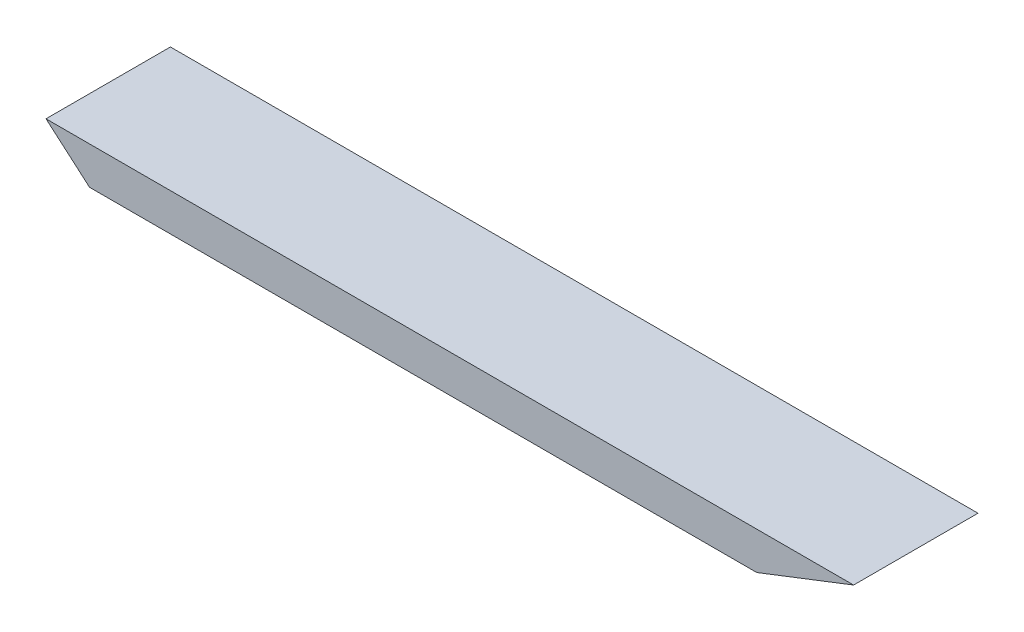
ISO-10303-21;
HEADER;
FILE_DESCRIPTION(('STEP AP214'),'2;1');
FILE_NAME('part.step','',(''),(''),'','','');
FILE_SCHEMA(('AUTOMOTIVE_DESIGN { 1 0 10303 214 1 1 1 1 }'));
ENDSEC;
DATA;
#1=APPLICATION_CONTEXT('core data for automotive mechanical design processes');
#2=APPLICATION_PROTOCOL_DEFINITION('international standard','automotive_design',2000,#1);
#3=PRODUCT_CONTEXT('',#1,'mechanical');
#4=PRODUCT('Part','Part','',(#3));
#5=PRODUCT_RELATED_PRODUCT_CATEGORY('part','',(#4));
#6=PRODUCT_DEFINITION_FORMATION('','',#4);
#7=PRODUCT_DEFINITION_CONTEXT('part definition',#1,'design');
#8=PRODUCT_DEFINITION('design','',#6,#7);
#9=PRODUCT_DEFINITION_SHAPE('','',#8);
#10=(LENGTH_UNIT() NAMED_UNIT(*) SI_UNIT(.MILLI.,.METRE.));
#11=(NAMED_UNIT(*) PLANE_ANGLE_UNIT() SI_UNIT($,.RADIAN.));
#12=(NAMED_UNIT(*) SI_UNIT($,.STERADIAN.) SOLID_ANGLE_UNIT());
#13=UNCERTAINTY_MEASURE_WITH_UNIT(LENGTH_MEASURE(1.E-05),#10,'distance_accuracy_value','');
#14=(GEOMETRIC_REPRESENTATION_CONTEXT(3) GLOBAL_UNCERTAINTY_ASSIGNED_CONTEXT((#13)) GLOBAL_UNIT_ASSIGNED_CONTEXT((#10,
#11,#12)) REPRESENTATION_CONTEXT('',''));
#15=CARTESIAN_POINT('',(0.,0.,0.));
#16=DIRECTION('',(0.,0.,1.));
#17=DIRECTION('',(1.,0.,0.));
#18=AXIS2_PLACEMENT_3D('',#15,#16,#17);
#19=CARTESIAN_POINT('',(-12.2519290125404,1.83230363325613,6.));
#20=DIRECTION('',(0.653288473477182,0.757109087530887,0.));
#21=DIRECTION('',(-0.757109087530887,0.653288473477183,0.));
#22=AXIS2_PLACEMENT_3D('',#19,#20,#21);
#23=PLANE('',#22);
#24=DIRECTION('',(0.757109087530887,-0.653288473477182,0.));
#25=VECTOR('',#24,1.);
#26=CARTESIAN_POINT('',(-12.2519290125404,1.83230363325613,0.));
#27=LINE('',#26,#25);
#28=CARTESIAN_POINT('',(-14.3521524528302,3.64452830188679,0.));
#29=VERTEX_POINT('',#28);
#30=CARTESIAN_POINT('',(-12.2519290125404,1.83230363325613,0.));
#31=VERTEX_POINT('',#30);
#32=EDGE_CURVE('E96',#29,#31,#27,.T.);
#33=ORIENTED_EDGE('',*,*,#32,.T.);
#34=DIRECTION('',(0.,0.,-1.));
#35=VECTOR('',#34,1.);
#36=CARTESIAN_POINT('',(-12.2519290125404,1.83230363325613,6.));
#37=LINE('',#36,#35);
#38=CARTESIAN_POINT('',(-12.2519290125404,1.83230363325613,6.));
#39=VERTEX_POINT('',#38);
#40=EDGE_CURVE('E11',#39,#31,#37,.T.);
#41=ORIENTED_EDGE('',*,*,#40,.F.);
#42=DIRECTION('',(0.757109087530887,-0.653288473477182,0.));
#43=VECTOR('',#42,1.);
#44=CARTESIAN_POINT('',(-12.2519290125404,1.83230363325613,6.));
#45=LINE('',#44,#43);
#46=CARTESIAN_POINT('',(-14.3521524528302,3.64452830188679,6.));
#47=VERTEX_POINT('',#46);
#48=EDGE_CURVE('E84',#47,#39,#45,.T.);
#49=ORIENTED_EDGE('',*,*,#48,.F.);
#50=DIRECTION('',(0.,0.,-1.));
#51=VECTOR('',#50,1.);
#52=CARTESIAN_POINT('',(-14.3521524528302,3.64452830188679,6.));
#53=LINE('',#52,#51);
#54=EDGE_CURVE('E92',#47,#29,#53,.T.);
#55=ORIENTED_EDGE('',*,*,#54,.T.);
#56=EDGE_LOOP('',(#33,#41,#49,#55));
#57=FACE_BOUND('',#56,.T.);
#58=ADVANCED_FACE('F33',(#57),#23,.F.);
#59=CARTESIAN_POINT('',(19.9280709874596,1.83230363325613,6.));
#60=DIRECTION('',(0.,1.,0.));
#61=DIRECTION('',(0.,0.,1.));
#62=AXIS2_PLACEMENT_3D('',#59,#60,#61);
#63=PLANE('',#62);
#64=DIRECTION('',(1.,0.,0.));
#65=VECTOR('',#64,1.);
#66=CARTESIAN_POINT('',(19.9280709874596,1.83230363325613,0.));
#67=LINE('',#66,#65);
#68=CARTESIAN_POINT('',(19.9280709874596,1.83230363325613,0.));
#69=VERTEX_POINT('',#68);
#70=EDGE_CURVE('E88',#31,#69,#67,.T.);
#71=ORIENTED_EDGE('',*,*,#70,.T.);
#72=DIRECTION('',(0.,0.,-1.));
#73=VECTOR('',#72,1.);
#74=CARTESIAN_POINT('',(19.9280709874596,1.83230363325613,6.));
#75=LINE('',#74,#73);
#76=CARTESIAN_POINT('',(19.9280709874596,1.83230363325613,6.));
#77=VERTEX_POINT('',#76);
#78=EDGE_CURVE('E41',#77,#69,#75,.T.);
#79=ORIENTED_EDGE('',*,*,#78,.F.);
#80=DIRECTION('',(1.,0.,0.));
#81=VECTOR('',#80,1.);
#82=CARTESIAN_POINT('',(19.9280709874596,1.83230363325613,6.));
#83=LINE('',#82,#81);
#84=EDGE_CURVE('E79',#39,#77,#83,.T.);
#85=ORIENTED_EDGE('',*,*,#84,.F.);
#86=ORIENTED_EDGE('',*,*,#40,.T.);
#87=EDGE_LOOP('',(#71,#79,#85,#86));
#88=FACE_BOUND('',#87,.T.);
#89=ADVANCED_FACE('F87',(#88),#63,.F.);
#90=CARTESIAN_POINT('',(24.5978475471698,3.6445283018868,6.));
#91=DIRECTION('',(-0.361787285773661,0.932260671621691,0.));
#92=DIRECTION('',(-0.932260671621692,-0.361787285773661,0.));
#93=AXIS2_PLACEMENT_3D('',#90,#91,#92);
#94=PLANE('',#93);
#95=DIRECTION('',(0.932260671621692,0.361787285773661,0.));
#96=VECTOR('',#95,1.);
#97=CARTESIAN_POINT('',(24.5978475471698,3.6445283018868,0.));
#98=LINE('',#97,#96);
#99=CARTESIAN_POINT('',(24.5978475471698,3.6445283018868,0.));
#100=VERTEX_POINT('',#99);
#101=EDGE_CURVE('E66',#69,#100,#98,.T.);
#102=ORIENTED_EDGE('',*,*,#101,.T.);
#103=DIRECTION('',(0.,0.,-1.));
#104=VECTOR('',#103,1.);
#105=CARTESIAN_POINT('',(24.5978475471698,3.6445283018868,6.));
#106=LINE('',#105,#104);
#107=CARTESIAN_POINT('',(24.5978475471698,3.6445283018868,6.));
#108=VERTEX_POINT('',#107);
#109=EDGE_CURVE('E89',#108,#100,#106,.T.);
#110=ORIENTED_EDGE('',*,*,#109,.F.);
#111=DIRECTION('',(0.932260671621692,0.361787285773661,0.));
#112=VECTOR('',#111,1.);
#113=CARTESIAN_POINT('',(24.5978475471698,3.6445283018868,6.));
#114=LINE('',#113,#112);
#115=EDGE_CURVE('E82',#77,#108,#114,.T.);
#116=ORIENTED_EDGE('',*,*,#115,.F.);
#117=ORIENTED_EDGE('',*,*,#78,.T.);
#118=EDGE_LOOP('',(#102,#110,#116,#117));
#119=FACE_BOUND('',#118,.T.);
#120=ADVANCED_FACE('F90',(#119),#94,.F.);
#121=CARTESIAN_POINT('',(-14.3521524528302,3.64452830188679,6.));
#122=DIRECTION('',(0.,-1.,0.));
#123=DIRECTION('',(1.,0.,0.));
#124=AXIS2_PLACEMENT_3D('',#121,#122,#123);
#125=PLANE('',#124);
#126=DIRECTION('',(-1.,0.,0.));
#127=VECTOR('',#126,1.);
#128=CARTESIAN_POINT('',(-14.3521524528302,3.64452830188679,0.));
#129=LINE('',#128,#127);
#130=EDGE_CURVE('E72',#100,#29,#129,.T.);
#131=ORIENTED_EDGE('',*,*,#130,.T.);
#132=ORIENTED_EDGE('',*,*,#54,.F.);
#133=DIRECTION('',(-1.,0.,0.));
#134=VECTOR('',#133,1.);
#135=CARTESIAN_POINT('',(-14.3521524528302,3.64452830188679,6.));
#136=LINE('',#135,#134);
#137=EDGE_CURVE('E49',#108,#47,#136,.T.);
#138=ORIENTED_EDGE('',*,*,#137,.F.);
#139=ORIENTED_EDGE('',*,*,#109,.T.);
#140=EDGE_LOOP('',(#131,#132,#138,#139));
#141=FACE_BOUND('',#140,.T.);
#142=ADVANCED_FACE('F103',(#141),#125,.F.);
#143=CARTESIAN_POINT('',(0.,0.,6.));
#144=DIRECTION('',(0.,0.,1.));
#145=DIRECTION('',(1.,0.,0.));
#146=AXIS2_PLACEMENT_3D('',#143,#144,#145);
#147=PLANE('',#146);
#148=ORIENTED_EDGE('',*,*,#48,.T.);
#149=ORIENTED_EDGE('',*,*,#84,.T.);
#150=ORIENTED_EDGE('',*,*,#115,.T.);
#151=ORIENTED_EDGE('',*,*,#137,.T.);
#152=EDGE_LOOP('',(#148,#149,#150,#151));
#153=FACE_BOUND('',#152,.T.);
#154=ADVANCED_FACE('F80',(#153),#147,.T.);
#155=CARTESIAN_POINT('',(0.,0.,0.));
#156=DIRECTION('',(0.,0.,1.));
#157=DIRECTION('',(1.,0.,0.));
#158=AXIS2_PLACEMENT_3D('',#155,#156,#157);
#159=PLANE('',#158);
#160=ORIENTED_EDGE('',*,*,#32,.F.);
#161=ORIENTED_EDGE('',*,*,#130,.F.);
#162=ORIENTED_EDGE('',*,*,#101,.F.);
#163=ORIENTED_EDGE('',*,*,#70,.F.);
#164=EDGE_LOOP('',(#160,#161,#162,#163));
#165=FACE_BOUND('',#164,.T.);
#166=ADVANCED_FACE('F106',(#165),#159,.F.);
#167=CLOSED_SHELL('',(#58,#89,#120,#142,#154,#166));
#168=MANIFOLD_SOLID_BREP('B2',#167);
#169=ADVANCED_BREP_SHAPE_REPRESENTATION('',(#18,#168),#14);
#170=SHAPE_DEFINITION_REPRESENTATION(#9,#169);
ENDSEC;
END-ISO-10303-21;
